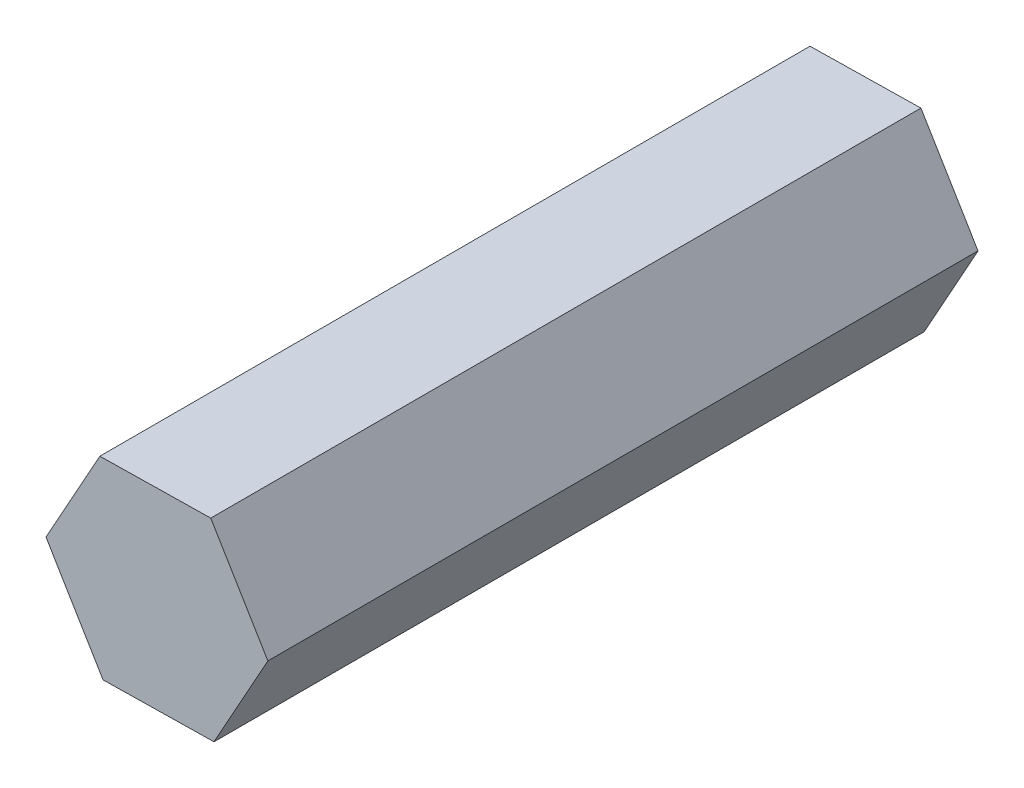
ISO-10303-21;
HEADER;
FILE_DESCRIPTION(('STEP AP214'),'2;1');
FILE_NAME('part.step','',(''),(''),'','','');
FILE_SCHEMA(('AUTOMOTIVE_DESIGN { 1 0 10303 214 1 1 1 1 }'));
ENDSEC;
DATA;
#1=APPLICATION_CONTEXT('core data for automotive mechanical design processes');
#2=APPLICATION_PROTOCOL_DEFINITION('international standard','automotive_design',2000,#1);
#3=PRODUCT_CONTEXT('',#1,'mechanical');
#4=PRODUCT('Part','Part','',(#3));
#5=PRODUCT_RELATED_PRODUCT_CATEGORY('part','',(#4));
#6=PRODUCT_DEFINITION_FORMATION('','',#4);
#7=PRODUCT_DEFINITION_CONTEXT('part definition',#1,'design');
#8=PRODUCT_DEFINITION('design','',#6,#7);
#9=PRODUCT_DEFINITION_SHAPE('','',#8);
#10=(LENGTH_UNIT() NAMED_UNIT(*) SI_UNIT(.MILLI.,.METRE.));
#11=(NAMED_UNIT(*) PLANE_ANGLE_UNIT() SI_UNIT($,.RADIAN.));
#12=(NAMED_UNIT(*) SI_UNIT($,.STERADIAN.) SOLID_ANGLE_UNIT());
#13=UNCERTAINTY_MEASURE_WITH_UNIT(LENGTH_MEASURE(1.E-05),#10,'distance_accuracy_value','');
#14=(GEOMETRIC_REPRESENTATION_CONTEXT(3) GLOBAL_UNCERTAINTY_ASSIGNED_CONTEXT((#13)) GLOBAL_UNIT_ASSIGNED_CONTEXT((#10,
#11,#12)) REPRESENTATION_CONTEXT('',''));
#15=CARTESIAN_POINT('',(0.,0.,0.));
#16=DIRECTION('',(0.,0.,1.));
#17=DIRECTION('',(1.,0.,0.));
#18=AXIS2_PLACEMENT_3D('',#15,#16,#17);
#19=CARTESIAN_POINT('',(-5.30974459405509,24.5164110183303,17.));
#20=DIRECTION('',(-0.016819931483241,0.999858534946269,0.));
#21=DIRECTION('',(-0.999858534946269,-0.016819931483241,0.));
#22=AXIS2_PLACEMENT_3D('',#19,#20,#21);
#23=PLANE('',#22);
#24=DIRECTION('',(0.999858534946269,0.016819931483241,0.));
#25=VECTOR('',#24,1.);
#26=CARTESIAN_POINT('',(-5.30974459405509,24.5164110183303,0.));
#27=LINE('',#26,#25);
#28=CARTESIAN_POINT('',(-5.30974459405509,24.5164110183303,0.));
#29=VERTEX_POINT('',#28);
#30=CARTESIAN_POINT('',(-2.65430906026234,24.5610815813905,0.));
#31=VERTEX_POINT('',#30);
#32=EDGE_CURVE('E123',#29,#31,#27,.T.);
#33=ORIENTED_EDGE('',*,*,#32,.T.);
#34=DIRECTION('',(0.,0.,-1.));
#35=VECTOR('',#34,1.);
#36=CARTESIAN_POINT('',(-2.65430906026234,24.5610815813905,17.));
#37=LINE('',#36,#35);
#38=CARTESIAN_POINT('',(-2.65430906026234,24.5610815813905,17.));
#39=VERTEX_POINT('',#38);
#40=EDGE_CURVE('E11',#39,#31,#37,.T.);
#41=ORIENTED_EDGE('',*,*,#40,.F.);
#42=DIRECTION('',(0.999858534946269,0.016819931483241,0.));
#43=VECTOR('',#42,1.);
#44=CARTESIAN_POINT('',(-5.30974459405509,24.5164110183303,17.));
#45=LINE('',#44,#43);
#46=CARTESIAN_POINT('',(-5.30974459405509,24.5164110183303,17.));
#47=VERTEX_POINT('',#46);
#48=EDGE_CURVE('E133',#47,#39,#45,.T.);
#49=ORIENTED_EDGE('',*,*,#48,.F.);
#50=DIRECTION('',(0.,0.,-1.));
#51=VECTOR('',#50,1.);
#52=CARTESIAN_POINT('',(-5.30974459405509,24.5164110183303,17.));
#53=LINE('',#52,#51);
#54=EDGE_CURVE('E119',#47,#29,#53,.T.);
#55=ORIENTED_EDGE('',*,*,#54,.T.);
#56=EDGE_LOOP('',(#33,#41,#49,#55));
#57=FACE_BOUND('',#56,.T.);
#58=ADVANCED_FACE('F39',(#57),#23,.F.);
#59=CARTESIAN_POINT('',(-2.65430906026234,24.5610815813905,17.));
#60=DIRECTION('',(-0.87431285719578,0.485362779518734,0.));
#61=DIRECTION('',(-0.485362779518734,-0.87431285719578,0.));
#62=AXIS2_PLACEMENT_3D('',#59,#60,#61);
#63=PLANE('',#62);
#64=DIRECTION('',(0.485362779518734,0.87431285719578,0.));
#65=VECTOR('',#64,1.);
#66=CARTESIAN_POINT('',(-2.65430906026234,24.5610815813905,0.));
#67=LINE('',#66,#65);
#68=CARTESIAN_POINT('',(-1.36527713577741,26.883091493297,0.));
#69=VERTEX_POINT('',#68);
#70=EDGE_CURVE('E126',#31,#69,#67,.T.);
#71=ORIENTED_EDGE('',*,*,#70,.T.);
#72=DIRECTION('',(0.,0.,-1.));
#73=VECTOR('',#72,1.);
#74=CARTESIAN_POINT('',(-1.36527713577741,26.883091493297,17.));
#75=LINE('',#74,#73);
#76=CARTESIAN_POINT('',(-1.36527713577741,26.883091493297,17.));
#77=VERTEX_POINT('',#76);
#78=EDGE_CURVE('E47',#77,#69,#75,.T.);
#79=ORIENTED_EDGE('',*,*,#78,.F.);
#80=DIRECTION('',(0.485362779518734,0.87431285719578,0.));
#81=VECTOR('',#80,1.);
#82=CARTESIAN_POINT('',(-2.65430906026234,24.5610815813905,17.));
#83=LINE('',#82,#81);
#84=EDGE_CURVE('E92',#39,#77,#83,.T.);
#85=ORIENTED_EDGE('',*,*,#84,.F.);
#86=ORIENTED_EDGE('',*,*,#40,.T.);
#87=EDGE_LOOP('',(#71,#79,#85,#86));
#88=FACE_BOUND('',#87,.T.);
#89=ADVANCED_FACE('F157',(#88),#63,.F.);
#90=CARTESIAN_POINT('',(-1.36527713577741,26.883091493297,17.));
#91=DIRECTION('',(-0.857492925712539,-0.514495755427535,0.));
#92=DIRECTION('',(0.514495755427535,-0.857492925712539,0.));
#93=AXIS2_PLACEMENT_3D('',#90,#91,#92);
#94=PLANE('',#93);
#95=DIRECTION('',(-0.514495755427535,0.857492925712539,0.));
#96=VECTOR('',#95,1.);
#97=CARTESIAN_POINT('',(-1.36527713577741,26.883091493297,0.));
#98=LINE('',#97,#96);
#99=CARTESIAN_POINT('',(-2.73168074508524,29.1604308421433,0.));
#100=VERTEX_POINT('',#99);
#101=EDGE_CURVE('E128',#69,#100,#98,.T.);
#102=ORIENTED_EDGE('',*,*,#101,.T.);
#103=DIRECTION('',(0.,0.,-1.));
#104=VECTOR('',#103,1.);
#105=CARTESIAN_POINT('',(-2.73168074508524,29.1604308421433,17.));
#106=LINE('',#105,#104);
#107=CARTESIAN_POINT('',(-2.73168074508524,29.1604308421433,17.));
#108=VERTEX_POINT('',#107);
#109=EDGE_CURVE('E114',#108,#100,#106,.T.);
#110=ORIENTED_EDGE('',*,*,#109,.F.);
#111=DIRECTION('',(-0.514495755427535,0.857492925712539,0.));
#112=VECTOR('',#111,1.);
#113=CARTESIAN_POINT('',(-1.36527713577741,26.883091493297,17.));
#114=LINE('',#113,#112);
#115=EDGE_CURVE('E105',#77,#108,#114,.T.);
#116=ORIENTED_EDGE('',*,*,#115,.F.);
#117=ORIENTED_EDGE('',*,*,#78,.T.);
#118=EDGE_LOOP('',(#102,#110,#116,#117));
#119=FACE_BOUND('',#118,.T.);
#120=ADVANCED_FACE('F139',(#119),#94,.F.);
#121=CARTESIAN_POINT('',(-2.73168074508524,29.1604308421433,17.));
#122=DIRECTION('',(0.016819931483241,-0.999858534946269,0.));
#123=DIRECTION('',(0.999858534946269,0.016819931483241,0.));
#124=AXIS2_PLACEMENT_3D('',#121,#122,#123);
#125=PLANE('',#124);
#126=DIRECTION('',(-0.999858534946269,-0.016819931483241,0.));
#127=VECTOR('',#126,1.);
#128=CARTESIAN_POINT('',(-2.73168074508524,29.1604308421433,0.));
#129=LINE('',#128,#127);
#130=CARTESIAN_POINT('',(-5.387116278878,29.1157602790832,0.));
#131=VERTEX_POINT('',#130);
#132=EDGE_CURVE('E113',#100,#131,#129,.T.);
#133=ORIENTED_EDGE('',*,*,#132,.T.);
#134=DIRECTION('',(0.,0.,-1.));
#135=VECTOR('',#134,1.);
#136=CARTESIAN_POINT('',(-5.387116278878,29.1157602790832,17.));
#137=LINE('',#136,#135);
#138=CARTESIAN_POINT('',(-5.387116278878,29.1157602790832,17.));
#139=VERTEX_POINT('',#138);
#140=EDGE_CURVE('E110',#139,#131,#137,.T.);
#141=ORIENTED_EDGE('',*,*,#140,.F.);
#142=DIRECTION('',(-0.999858534946269,-0.016819931483241,0.));
#143=VECTOR('',#142,1.);
#144=CARTESIAN_POINT('',(-2.73168074508524,29.1604308421433,17.));
#145=LINE('',#144,#143);
#146=EDGE_CURVE('E99',#108,#139,#145,.T.);
#147=ORIENTED_EDGE('',*,*,#146,.F.);
#148=ORIENTED_EDGE('',*,*,#109,.T.);
#149=EDGE_LOOP('',(#133,#141,#147,#148));
#150=FACE_BOUND('',#149,.T.);
#151=ADVANCED_FACE('F111',(#150),#125,.F.);
#152=CARTESIAN_POINT('',(-5.387116278878,29.1157602790832,17.));
#153=DIRECTION('',(0.874312857195781,-0.485362779518734,0.));
#154=DIRECTION('',(0.485362779518734,0.874312857195781,0.));
#155=AXIS2_PLACEMENT_3D('',#152,#153,#154);
#156=PLANE('',#155);
#157=DIRECTION('',(-0.485362779518734,-0.87431285719578,0.));
#158=VECTOR('',#157,1.);
#159=CARTESIAN_POINT('',(-5.387116278878,29.1157602790832,0.));
#160=LINE('',#159,#158);
#161=CARTESIAN_POINT('',(-6.67614820336292,26.7937503671767,0.));
#162=VERTEX_POINT('',#161);
#163=EDGE_CURVE('E78',#131,#162,#160,.T.);
#164=ORIENTED_EDGE('',*,*,#163,.T.);
#165=DIRECTION('',(0.,0.,-1.));
#166=VECTOR('',#165,1.);
#167=CARTESIAN_POINT('',(-6.67614820336292,26.7937503671767,17.));
#168=LINE('',#167,#166);
#169=CARTESIAN_POINT('',(-6.67614820336292,26.7937503671767,17.));
#170=VERTEX_POINT('',#169);
#171=EDGE_CURVE('E115',#170,#162,#168,.T.);
#172=ORIENTED_EDGE('',*,*,#171,.F.);
#173=DIRECTION('',(-0.485362779518734,-0.87431285719578,0.));
#174=VECTOR('',#173,1.);
#175=CARTESIAN_POINT('',(-5.387116278878,29.1157602790832,17.));
#176=LINE('',#175,#174);
#177=EDGE_CURVE('E103',#139,#170,#176,.T.);
#178=ORIENTED_EDGE('',*,*,#177,.F.);
#179=ORIENTED_EDGE('',*,*,#140,.T.);
#180=EDGE_LOOP('',(#164,#172,#178,#179));
#181=FACE_BOUND('',#180,.T.);
#182=ADVANCED_FACE('F117',(#181),#156,.F.);
#183=CARTESIAN_POINT('',(-6.67614820336292,26.7937503671767,17.));
#184=DIRECTION('',(0.85749292571254,0.514495755427535,0.));
#185=DIRECTION('',(-0.514495755427535,0.857492925712539,0.));
#186=AXIS2_PLACEMENT_3D('',#183,#184,#185);
#187=PLANE('',#186);
#188=DIRECTION('',(0.514495755427535,-0.857492925712539,0.));
#189=VECTOR('',#188,1.);
#190=CARTESIAN_POINT('',(-6.67614820336292,26.7937503671767,0.));
#191=LINE('',#190,#189);
#192=EDGE_CURVE('E84',#162,#29,#191,.T.);
#193=ORIENTED_EDGE('',*,*,#192,.T.);
#194=ORIENTED_EDGE('',*,*,#54,.F.);
#195=DIRECTION('',(0.514495755427535,-0.857492925712539,0.));
#196=VECTOR('',#195,1.);
#197=CARTESIAN_POINT('',(-6.67614820336292,26.7937503671767,17.));
#198=LINE('',#197,#196);
#199=EDGE_CURVE('E55',#170,#47,#198,.T.);
#200=ORIENTED_EDGE('',*,*,#199,.F.);
#201=ORIENTED_EDGE('',*,*,#171,.T.);
#202=EDGE_LOOP('',(#193,#194,#200,#201));
#203=FACE_BOUND('',#202,.T.);
#204=ADVANCED_FACE('F146',(#203),#187,.F.);
#205=CARTESIAN_POINT('',(0.,0.,17.));
#206=DIRECTION('',(0.,0.,1.));
#207=DIRECTION('',(1.,0.,0.));
#208=AXIS2_PLACEMENT_3D('',#205,#206,#207);
#209=PLANE('',#208);
#210=ORIENTED_EDGE('',*,*,#48,.T.);
#211=ORIENTED_EDGE('',*,*,#84,.T.);
#212=ORIENTED_EDGE('',*,*,#115,.T.);
#213=ORIENTED_EDGE('',*,*,#146,.T.);
#214=ORIENTED_EDGE('',*,*,#177,.T.);
#215=ORIENTED_EDGE('',*,*,#199,.T.);
#216=EDGE_LOOP('',(#210,#211,#212,#213,#214,#215));
#217=FACE_BOUND('',#216,.T.);
#218=ADVANCED_FACE('F101',(#217),#209,.T.);
#219=CARTESIAN_POINT('',(0.,0.,0.));
#220=DIRECTION('',(0.,0.,1.));
#221=DIRECTION('',(1.,0.,0.));
#222=AXIS2_PLACEMENT_3D('',#219,#220,#221);
#223=PLANE('',#222);
#224=ORIENTED_EDGE('',*,*,#32,.F.);
#225=ORIENTED_EDGE('',*,*,#192,.F.);
#226=ORIENTED_EDGE('',*,*,#163,.F.);
#227=ORIENTED_EDGE('',*,*,#132,.F.);
#228=ORIENTED_EDGE('',*,*,#101,.F.);
#229=ORIENTED_EDGE('',*,*,#70,.F.);
#230=EDGE_LOOP('',(#224,#225,#226,#227,#228,#229));
#231=FACE_BOUND('',#230,.T.);
#232=ADVANCED_FACE('F142',(#231),#223,.F.);
#233=CLOSED_SHELL('',(#58,#89,#120,#151,#182,#204,#218,#232));
#234=MANIFOLD_SOLID_BREP('B2',#233);
#235=ADVANCED_BREP_SHAPE_REPRESENTATION('',(#18,#234),#14);
#236=SHAPE_DEFINITION_REPRESENTATION(#9,#235);
ENDSEC;
END-ISO-10303-21;
